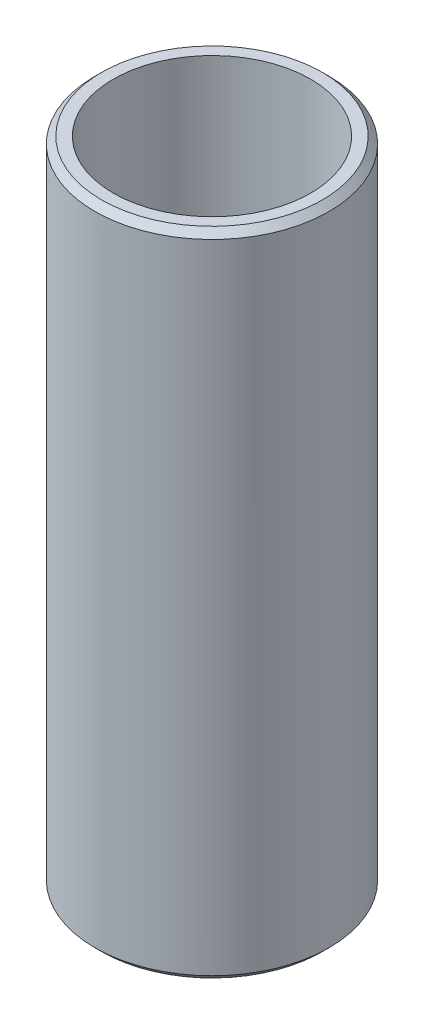
ISO-10303-21;
HEADER;
FILE_DESCRIPTION(('STEP AP214'),'2;1');
FILE_NAME('part.step','',(''),(''),'','','');
FILE_SCHEMA(('AUTOMOTIVE_DESIGN { 1 0 10303 214 1 1 1 1 }'));
ENDSEC;
DATA;
#1=APPLICATION_CONTEXT('core data for automotive mechanical design processes');
#2=APPLICATION_PROTOCOL_DEFINITION('international standard','automotive_design',2000,#1);
#3=PRODUCT_CONTEXT('',#1,'mechanical');
#4=PRODUCT('Part','Part','',(#3));
#5=PRODUCT_RELATED_PRODUCT_CATEGORY('part','',(#4));
#6=PRODUCT_DEFINITION_FORMATION('','',#4);
#7=PRODUCT_DEFINITION_CONTEXT('part definition',#1,'design');
#8=PRODUCT_DEFINITION('design','',#6,#7);
#9=PRODUCT_DEFINITION_SHAPE('','',#8);
#10=(LENGTH_UNIT() NAMED_UNIT(*) SI_UNIT(.MILLI.,.METRE.));
#11=(NAMED_UNIT(*) PLANE_ANGLE_UNIT() SI_UNIT($,.RADIAN.));
#12=(NAMED_UNIT(*) SI_UNIT($,.STERADIAN.) SOLID_ANGLE_UNIT());
#13=UNCERTAINTY_MEASURE_WITH_UNIT(LENGTH_MEASURE(1.E-05),#10,'distance_accuracy_value','');
#14=(GEOMETRIC_REPRESENTATION_CONTEXT(3) GLOBAL_UNCERTAINTY_ASSIGNED_CONTEXT((#13)) GLOBAL_UNIT_ASSIGNED_CONTEXT((#10,
#11,#12)) REPRESENTATION_CONTEXT('',''));
#15=CARTESIAN_POINT('',(0.,0.,0.));
#16=DIRECTION('',(0.,0.,1.));
#17=DIRECTION('',(1.,0.,0.));
#18=AXIS2_PLACEMENT_3D('',#15,#16,#17);
#19=CARTESIAN_POINT('',(0.,319.575175078922,0.));
#20=DIRECTION('',(0.,-1.,0.));
#21=DIRECTION('',(0.,0.,-1.));
#22=AXIS2_PLACEMENT_3D('',#19,#20,#21);
#23=CYLINDRICAL_SURFACE('',#22,57.5);
#24=CARTESIAN_POINT('',(0.,316.293673636005,0.));
#25=DIRECTION('',(0.,1.,0.));
#26=DIRECTION('',(0.,0.,1.));
#27=AXIS2_PLACEMENT_3D('',#24,#25,#26);
#28=CIRCLE('',#27,57.5);
#29=CARTESIAN_POINT('',(0.,316.293673636005,-57.5));
#30=VERTEX_POINT('',#29);
#31=EDGE_CURVE('E50',#30,#30,#28,.F.);
#32=ORIENTED_EDGE('',*,*,#31,.T.);
#33=EDGE_LOOP('',(#32));
#34=FACE_BOUND('',#33,.T.);
#35=CARTESIAN_POINT('',(0.,3.28150144291711,0.));
#36=DIRECTION('',(0.,1.,0.));
#37=DIRECTION('',(0.,0.,1.));
#38=AXIS2_PLACEMENT_3D('',#35,#36,#37);
#39=CIRCLE('',#38,57.5);
#40=CARTESIAN_POINT('',(0.,3.28150144291711,57.5));
#41=VERTEX_POINT('',#40);
#42=EDGE_CURVE('E51',#41,#41,#39,.T.);
#43=ORIENTED_EDGE('',*,*,#42,.T.);
#44=EDGE_LOOP('',(#43));
#45=FACE_BOUND('',#44,.T.);
#46=ADVANCED_FACE('F39',(#34,#45),#23,.T.);
#47=CARTESIAN_POINT('',(0.,319.575175078922,0.));
#48=DIRECTION('',(0.,1.,0.));
#49=DIRECTION('',(0.,0.,1.));
#50=AXIS2_PLACEMENT_3D('',#47,#48,#49);
#51=PLANE('',#50);
#52=CARTESIAN_POINT('',(0.,319.575175078922,0.));
#53=DIRECTION('',(0.,1.,0.));
#54=DIRECTION('',(0.,0.,1.));
#55=AXIS2_PLACEMENT_3D('',#52,#53,#54);
#56=CIRCLE('',#55,54.218498557083);
#57=CARTESIAN_POINT('',(0.,319.575175078922,-54.218498557083));
#58=VERTEX_POINT('',#57);
#59=EDGE_CURVE('E54',#58,#58,#56,.T.);
#60=ORIENTED_EDGE('',*,*,#59,.T.);
#61=EDGE_LOOP('',(#60));
#62=FACE_BOUND('',#61,.T.);
#63=CARTESIAN_POINT('',(0.,319.575175078922,0.));
#64=DIRECTION('',(0.,1.,0.));
#65=DIRECTION('',(0.,0.,1.));
#66=AXIS2_PLACEMENT_3D('',#63,#64,#65);
#67=CIRCLE('',#66,48.4804959041319);
#68=CARTESIAN_POINT('',(0.,319.575175078922,48.4804959041319));
#69=VERTEX_POINT('',#68);
#70=EDGE_CURVE('E58',#69,#69,#67,.T.);
#71=ORIENTED_EDGE('',*,*,#70,.F.);
#72=EDGE_LOOP('',(#71));
#73=FACE_BOUND('',#72,.T.);
#74=ADVANCED_FACE('F69',(#62,#73),#51,.T.);
#75=CARTESIAN_POINT('',(0.,0.,0.));
#76=DIRECTION('',(0.,1.,0.));
#77=DIRECTION('',(0.,0.,1.));
#78=AXIS2_PLACEMENT_3D('',#75,#76,#77);
#79=PLANE('',#78);
#80=CARTESIAN_POINT('',(0.,0.,0.));
#81=DIRECTION('',(0.,1.,0.));
#82=DIRECTION('',(0.,0.,1.));
#83=AXIS2_PLACEMENT_3D('',#80,#81,#82);
#84=CIRCLE('',#83,54.2184985570829);
#85=CARTESIAN_POINT('',(0.,0.,54.2184985570829));
#86=VERTEX_POINT('',#85);
#87=EDGE_CURVE('E10',#86,#86,#84,.F.);
#88=ORIENTED_EDGE('',*,*,#87,.T.);
#89=EDGE_LOOP('',(#88));
#90=FACE_BOUND('',#89,.T.);
#91=CARTESIAN_POINT('',(0.,0.,0.));
#92=DIRECTION('',(0.,1.,0.));
#93=DIRECTION('',(0.,0.,1.));
#94=AXIS2_PLACEMENT_3D('',#91,#92,#93);
#95=CIRCLE('',#94,48.4804959041319);
#96=CARTESIAN_POINT('',(0.,0.,48.4804959041319));
#97=VERTEX_POINT('',#96);
#98=EDGE_CURVE('E63',#97,#97,#95,.T.);
#99=ORIENTED_EDGE('',*,*,#98,.T.);
#100=EDGE_LOOP('',(#99));
#101=FACE_BOUND('',#100,.T.);
#102=ADVANCED_FACE('F75',(#90,#101),#79,.F.);
#103=CARTESIAN_POINT('',(0.,319.575175078922,0.));
#104=DIRECTION('',(0.,-1.,0.));
#105=DIRECTION('',(0.,0.,-1.));
#106=AXIS2_PLACEMENT_3D('',#103,#104,#105);
#107=CYLINDRICAL_SURFACE('',#106,48.4804959041319);
#108=ORIENTED_EDGE('',*,*,#70,.T.);
#109=EDGE_LOOP('',(#108));
#110=FACE_BOUND('',#109,.T.);
#111=ORIENTED_EDGE('',*,*,#98,.F.);
#112=EDGE_LOOP('',(#111));
#113=FACE_BOUND('',#112,.T.);
#114=ADVANCED_FACE('F70',(#110,#113),#107,.F.);
#115=CARTESIAN_POINT('',(0.,319.575175078922,0.));
#116=DIRECTION('',(0.,-1.,0.));
#117=DIRECTION('',(0.,0.,-1.));
#118=AXIS2_PLACEMENT_3D('',#115,#116,#117);
#119=CONICAL_SURFACE('',#118,54.218498557083,0.78539816339744);
#120=CARTESIAN_POINT('',(0.,316.293673636005,-57.5));
#121=CARTESIAN_POINT('',(0.,316.327855942702,-57.465817693303));
#122=CARTESIAN_POINT('',(0.,316.362038249399,-57.4316353866059));
#123=CARTESIAN_POINT('',(0.,316.430402862793,-57.3632707732118));
#124=CARTESIAN_POINT('',(0.,316.46458516949,-57.3290884665148));
#125=CARTESIAN_POINT('',(0.,316.532949782885,-57.2607238531207));
#126=CARTESIAN_POINT('',(0.,316.567132089582,-57.2265415464236));
#127=CARTESIAN_POINT('',(0.,316.635496702976,-57.1581769330295));
#128=CARTESIAN_POINT('',(0.,316.669679009673,-57.1239946263325));
#129=CARTESIAN_POINT('',(0.,316.738043623067,-57.0556300129384));
#130=CARTESIAN_POINT('',(0.,316.772225929764,-57.0214477062413));
#131=CARTESIAN_POINT('',(0.,316.840590543158,-56.9530830928472));
#132=CARTESIAN_POINT('',(0.,316.874772849855,-56.9189007861501));
#133=CARTESIAN_POINT('',(0.,316.943137463249,-56.850536172756));
#134=CARTESIAN_POINT('',(0.,316.977319769946,-56.816353866059));
#135=CARTESIAN_POINT('',(0.,317.04568438334,-56.7479892526649));
#136=CARTESIAN_POINT('',(0.,317.079866690037,-56.7138069459678));
#137=CARTESIAN_POINT('',(0.,317.148231303431,-56.6454423325737));
#138=CARTESIAN_POINT('',(0.,317.182413610129,-56.6112600258767));
#139=CARTESIAN_POINT('',(0.,317.250778223523,-56.5428954124826));
#140=CARTESIAN_POINT('',(0.,317.28496053022,-56.5087131057855));
#141=CARTESIAN_POINT('',(0.,317.353325143614,-56.4403484923914));
#142=CARTESIAN_POINT('',(0.,317.387507450311,-56.4061661856944));
#143=CARTESIAN_POINT('',(0.,317.455872063705,-56.3378015723003));
#144=CARTESIAN_POINT('',(0.,317.490054370402,-56.3036192656032));
#145=CARTESIAN_POINT('',(0.,317.558418983796,-56.2352546522091));
#146=CARTESIAN_POINT('',(0.,317.592601290493,-56.201072345512));
#147=CARTESIAN_POINT('',(0.,317.660965903887,-56.1327077321179));
#148=CARTESIAN_POINT('',(0.,317.695148210584,-56.0985254254209));
#149=CARTESIAN_POINT('',(0.,317.763512823978,-56.0301608120268));
#150=CARTESIAN_POINT('',(0.,317.797695130675,-55.9959785053297));
#151=CARTESIAN_POINT('',(0.,317.86605974407,-55.9276138919356));
#152=CARTESIAN_POINT('',(0.,317.900242050767,-55.8934315852386));
#153=CARTESIAN_POINT('',(0.,317.968606664161,-55.8250669718445));
#154=CARTESIAN_POINT('',(0.,318.002788970858,-55.7908846651474));
#155=CARTESIAN_POINT('',(0.,318.071153584252,-55.7225200517533));
#156=CARTESIAN_POINT('',(0.,318.105335890949,-55.6883377450563));
#157=CARTESIAN_POINT('',(0.,318.173700504343,-55.6199731316622));
#158=CARTESIAN_POINT('',(0.,318.20788281104,-55.5857908249651));
#159=CARTESIAN_POINT('',(0.,318.276247424434,-55.517426211571));
#160=CARTESIAN_POINT('',(0.,318.310429731131,-55.483243904874));
#161=CARTESIAN_POINT('',(0.,318.378794344525,-55.4148792914799));
#162=CARTESIAN_POINT('',(0.,318.412976651222,-55.3806969847828));
#163=CARTESIAN_POINT('',(0.,318.481341264617,-55.3123323713887));
#164=CARTESIAN_POINT('',(0.,318.515523571314,-55.2781500646916));
#165=CARTESIAN_POINT('',(0.,318.583888184708,-55.2097854512975));
#166=CARTESIAN_POINT('',(0.,318.618070491405,-55.1756031446005));
#167=CARTESIAN_POINT('',(0.,318.686435104799,-55.1072385312064));
#168=CARTESIAN_POINT('',(0.,318.720617411496,-55.0730562245093));
#169=CARTESIAN_POINT('',(0.,318.78898202489,-55.0046916111152));
#170=CARTESIAN_POINT('',(0.,318.823164331587,-54.9705093044182));
#171=CARTESIAN_POINT('',(0.,318.891528944981,-54.9021446910241));
#172=CARTESIAN_POINT('',(0.,318.925711251678,-54.867962384327));
#173=CARTESIAN_POINT('',(0.,318.994075865072,-54.7995977709329));
#174=CARTESIAN_POINT('',(0.,319.028258171769,-54.7654154642359));
#175=CARTESIAN_POINT('',(0.,319.096622785164,-54.6970508508418));
#176=CARTESIAN_POINT('',(0.,319.130805091861,-54.6628685441447));
#177=CARTESIAN_POINT('',(0.,319.199169705255,-54.5945039307506));
#178=CARTESIAN_POINT('',(0.,319.233352011952,-54.5603216240536));
#179=CARTESIAN_POINT('',(0.,319.301716625346,-54.4919570106594));
#180=CARTESIAN_POINT('',(0.,319.335898932043,-54.4577747039624));
#181=CARTESIAN_POINT('',(0.,319.404263545437,-54.3894100905683));
#182=CARTESIAN_POINT('',(0.,319.438445852134,-54.3552277838712));
#183=CARTESIAN_POINT('',(0.,319.506810465528,-54.2868631704771));
#184=CARTESIAN_POINT('',(0.,319.540992772225,-54.2526808637801));
#185=CARTESIAN_POINT('',(0.,319.575175078922,-54.218498557083));
#186=B_SPLINE_CURVE_WITH_KNOTS('',3,(#120,#121,#122,#123,#124,#125,#126,#127,#128,#129,#130,
#131,#132,#133,#134,#135,#136,#137,#138,#139,#140,#141,#142,#143,#144,#145,#146,#147,#148,#149,
#150,#151,#152,#153,#154,#155,#156,#157,#158,#159,#160,#161,#162,#163,#164,#165,#166,#167,#168,
#169,#170,#171,#172,#173,#174,#175,#176,#177,#178,#179,#180,#181,#182,#183,#184,#185),
.UNSPECIFIED.,.F.,.F.,(4,2,2,2,2,2,2,2,2,2,2,2,2,2,2,2,2,2,2,2,2,2,2,2,2,2,2,2,2,2,2,2,4),(0.,
0.145023245172501,0.290046490344997,0.435069735517497,0.580092980689998,0.725116225862499,
0.870139471034995,1.0151627162075,1.16018596138004,1.30520920655254,1.45023245172503,
1.59525569689753,1.74027894207003,1.88530218724253,2.03032543241503,2.17534867758753,
2.32037192276007,2.46539516793257,2.61041841310507,2.75544165827757,2.90046490345007,
3.04548814862257,3.19051139379507,3.33553463896757,3.48055788414011,3.62558112931261,
3.7706043744851,3.9156276196576,4.06065086483011,4.20567411000261,4.3506973551751,
4.4957206003476,4.64074384552014),.UNSPECIFIED.);
#187=EDGE_CURVE('BSEAM81',#30,#58,#186,.T.);
#188=ORIENTED_EDGE('',*,*,#31,.F.);
#189=ORIENTED_EDGE('',*,*,#59,.F.);
#190=ORIENTED_EDGE('',*,*,#187,.T.);
#191=ORIENTED_EDGE('',*,*,#187,.F.);
#192=EDGE_LOOP('',(#188,#190,#189,#191));
#193=FACE_BOUND('',#192,.T.);
#194=ADVANCED_FACE('F81',(#193),#119,.T.);
#195=CARTESIAN_POINT('',(0.,3.28150144291711,0.));
#196=DIRECTION('',(0.,1.,0.));
#197=DIRECTION('',(0.,0.,1.));
#198=AXIS2_PLACEMENT_3D('',#195,#196,#197);
#199=CONICAL_SURFACE('',#198,57.5,0.785398163397452);
#200=ORIENTED_EDGE('',*,*,#87,.F.);
#201=EDGE_LOOP('',(#200));
#202=FACE_BOUND('',#201,.T.);
#203=ORIENTED_EDGE('',*,*,#42,.F.);
#204=EDGE_LOOP('',(#203));
#205=FACE_BOUND('',#204,.T.);
#206=ADVANCED_FACE('F45',(#202,#205),#199,.T.);
#207=CLOSED_SHELL('',(#46,#74,#102,#114,#194,#206));
#208=MANIFOLD_SOLID_BREP('B2',#207);
#209=ADVANCED_BREP_SHAPE_REPRESENTATION('',(#18,#208),#14);
#210=SHAPE_DEFINITION_REPRESENTATION(#9,#209);
ENDSEC;
END-ISO-10303-21;
